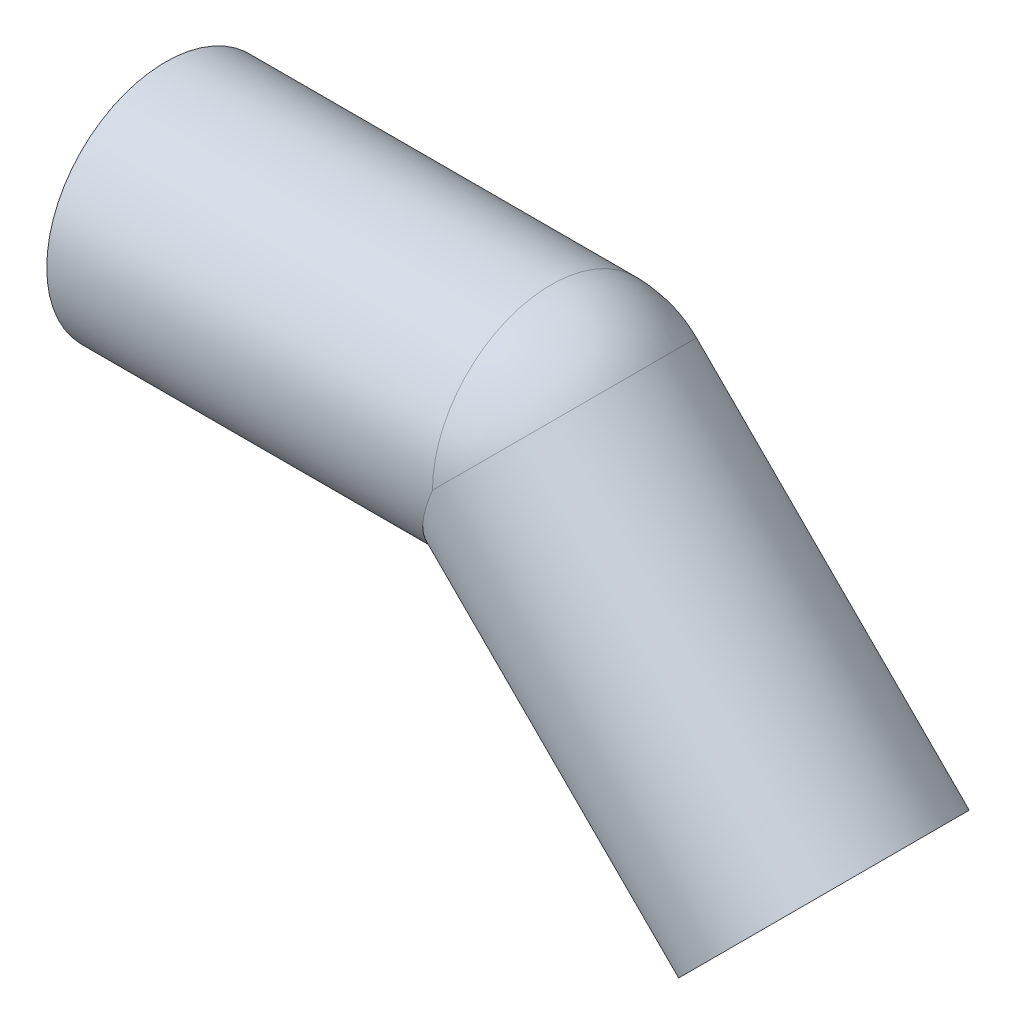
ISO-10303-21;
HEADER;
FILE_DESCRIPTION(('STEP AP214'),'2;1');
FILE_NAME('part.step','',(''),(''),'','','');
FILE_SCHEMA(('AUTOMOTIVE_DESIGN { 1 0 10303 214 1 1 1 1 }'));
ENDSEC;
DATA;
#1=APPLICATION_CONTEXT('core data for automotive mechanical design processes');
#2=APPLICATION_PROTOCOL_DEFINITION('international standard','automotive_design',2000,#1);
#3=PRODUCT_CONTEXT('',#1,'mechanical');
#4=PRODUCT('Part','Part','',(#3));
#5=PRODUCT_RELATED_PRODUCT_CATEGORY('part','',(#4));
#6=PRODUCT_DEFINITION_FORMATION('','',#4);
#7=PRODUCT_DEFINITION_CONTEXT('part definition',#1,'design');
#8=PRODUCT_DEFINITION('design','',#6,#7);
#9=PRODUCT_DEFINITION_SHAPE('','',#8);
#10=(LENGTH_UNIT() NAMED_UNIT(*) SI_UNIT(.MILLI.,.METRE.));
#11=(NAMED_UNIT(*) PLANE_ANGLE_UNIT() SI_UNIT($,.RADIAN.));
#12=(NAMED_UNIT(*) SI_UNIT($,.STERADIAN.) SOLID_ANGLE_UNIT());
#13=UNCERTAINTY_MEASURE_WITH_UNIT(LENGTH_MEASURE(1.E-05),#10,'distance_accuracy_value','');
#14=(GEOMETRIC_REPRESENTATION_CONTEXT(3) GLOBAL_UNCERTAINTY_ASSIGNED_CONTEXT((#13)) GLOBAL_UNIT_ASSIGNED_CONTEXT((#10,
#11,#12)) REPRESENTATION_CONTEXT('',''));
#15=CARTESIAN_POINT('',(0.,0.,0.));
#16=DIRECTION('',(0.,0.,1.));
#17=DIRECTION('',(1.,0.,0.));
#18=AXIS2_PLACEMENT_3D('',#15,#16,#17);
#19=CARTESIAN_POINT('',(88.7695526217002,-36.7695526217012,0.));
#20=DIRECTION('',(-0.707106781186531,0.707106781186564,0.));
#21=DIRECTION('',(-0.707106781186564,-0.707106781186531,0.));
#22=AXIS2_PLACEMENT_3D('',#19,#20,#21);
#23=CYLINDRICAL_SURFACE('',#22,13.6);
#24=CARTESIAN_POINT('',(52.,0.,0.));
#25=DIRECTION('',(0.707106781186547,-0.707106781186548,0.));
#26=DIRECTION('',(0.,0.,-1.));
#27=AXIS2_PLACEMENT_3D('',#24,#25,#26);
#28=CIRCLE('',#27,13.6);
#29=CARTESIAN_POINT('',(61.6166522244259,9.61665222384815,0.));
#30=VERTEX_POINT('',#29);
#31=CARTESIAN_POINT('',(52.0000000000007,-2.89352133305626E-13,13.6));
#32=VERTEX_POINT('',#31);
#33=EDGE_CURVE('E53',#30,#32,#28,.T.);
#34=ORIENTED_EDGE('',*,*,#33,.F.);
#35=CARTESIAN_POINT('',(52.,0.,0.));
#36=DIRECTION('',(0.707106781122822,-0.707106781250273,0.));
#37=DIRECTION('',(0.,0.,-1.));
#38=AXIS2_PLACEMENT_3D('',#35,#36,#37);
#39=CIRCLE('',#38,13.6);
#40=CARTESIAN_POINT('',(52.0000000000007,-2.79811478516556E-13,-13.6));
#41=VERTEX_POINT('',#40);
#42=EDGE_CURVE('E46',#41,#30,#39,.T.);
#43=ORIENTED_EDGE('',*,*,#42,.F.);
#44=CARTESIAN_POINT('',(52.0000000000008,0.,0.));
#45=DIRECTION('',(-0.923879532511282,0.382683432365101,0.));
#46=DIRECTION('',(-0.382683432365101,-0.923879532511282,0.));
#47=AXIS2_PLACEMENT_3D('',#44,#45,#46);
#48=ELLIPSE('',#47,14.7205339239766,13.6);
#49=EDGE_CURVE('E55',#32,#41,#48,.F.);
#50=ORIENTED_EDGE('',*,*,#49,.F.);
#51=EDGE_LOOP('',(#34,#43,#50));
#52=FACE_BOUND('',#51,.T.);
#53=CARTESIAN_POINT('',(88.7695526216998,-36.7695526217007,0.));
#54=DIRECTION('',(-0.70710678118653,0.707106781186565,0.));
#55=DIRECTION('',(-0.707106781186565,-0.70710678118653,0.));
#56=AXIS2_PLACEMENT_3D('',#53,#54,#55);
#57=CIRCLE('',#56,13.6);
#58=CARTESIAN_POINT('',(79.1529003975624,-46.3862048458376,0.));
#59=VERTEX_POINT('',#58);
#60=EDGE_CURVE('E18',#59,#59,#57,.T.);
#61=ORIENTED_EDGE('',*,*,#60,.F.);
#62=EDGE_LOOP('',(#61));
#63=FACE_BOUND('',#62,.T.);
#64=ADVANCED_FACE('F15',(#52,#63),#23,.F.);
#65=CARTESIAN_POINT('',(52.,0.,0.));
#66=DIRECTION('',(0.,0.,1.));
#67=DIRECTION('',(-1.,0.,0.));
#68=AXIS2_PLACEMENT_3D('',#65,#66,#67);
#69=SPHERICAL_SURFACE('',#68,13.6);
#70=CARTESIAN_POINT('',(52.,0.,0.));
#71=DIRECTION('',(-1.,0.,0.));
#72=DIRECTION('',(0.,1.,0.));
#73=AXIS2_PLACEMENT_3D('',#70,#71,#72);
#74=CIRCLE('',#73,13.6);
#75=EDGE_CURVE('E51',#41,#32,#74,.F.);
#76=ORIENTED_EDGE('',*,*,#75,.F.);
#77=ORIENTED_EDGE('',*,*,#42,.T.);
#78=ORIENTED_EDGE('',*,*,#33,.T.);
#79=EDGE_LOOP('',(#76,#77,#78));
#80=FACE_BOUND('',#79,.T.);
#81=ADVANCED_FACE('F58',(#80),#69,.F.);
#82=CARTESIAN_POINT('',(100.083261120685,-25.4558441227157,16.1920021082981));
#83=DIRECTION('',(0.707106781186547,-0.707106781186548,0.));
#84=DIRECTION('',(-0.707106781186548,-0.707106781186547,0.));
#85=AXIS2_PLACEMENT_3D('',#82,#83,#84);
#86=PLANE('',#85);
#87=ORIENTED_EDGE('',*,*,#60,.T.);
#88=EDGE_LOOP('',(#87));
#89=FACE_BOUND('',#88,.T.);
#90=CARTESIAN_POINT('',(88.7695526216997,-36.7695526217007,0.));
#91=DIRECTION('',(-0.70710678118653,0.707106781186565,0.));
#92=DIRECTION('',(-0.707106781186565,-0.70710678118653,0.));
#93=AXIS2_PLACEMENT_3D('',#90,#91,#92);
#94=CIRCLE('',#93,16.);
#95=CARTESIAN_POINT('',(77.4558441227147,-48.0832611206852,0.));
#96=VERTEX_POINT('',#95);
#97=EDGE_CURVE('E75',#96,#96,#94,.T.);
#98=ORIENTED_EDGE('',*,*,#97,.F.);
#99=EDGE_LOOP('',(#98));
#100=FACE_BOUND('',#99,.T.);
#101=ADVANCED_FACE('F85',(#89,#100),#86,.T.);
#102=CARTESIAN_POINT('',(52.,0.,0.));
#103=DIRECTION('',(-1.,0.,0.));
#104=DIRECTION('',(0.,0.,1.));
#105=AXIS2_PLACEMENT_3D('',#102,#103,#104);
#106=CYLINDRICAL_SURFACE('',#105,13.6);
#107=CARTESIAN_POINT('',(0.,0.,0.));
#108=DIRECTION('',(-1.,0.,0.));
#109=DIRECTION('',(0.,0.,1.));
#110=AXIS2_PLACEMENT_3D('',#107,#108,#109);
#111=CIRCLE('',#110,13.6);
#112=CARTESIAN_POINT('',(0.,0.,13.6));
#113=VERTEX_POINT('',#112);
#114=EDGE_CURVE('E72',#113,#113,#111,.F.);
#115=ORIENTED_EDGE('',*,*,#114,.F.);
#116=EDGE_LOOP('',(#115));
#117=FACE_BOUND('',#116,.T.);
#118=ORIENTED_EDGE('',*,*,#49,.T.);
#119=ORIENTED_EDGE('',*,*,#75,.T.);
#120=EDGE_LOOP('',(#118,#119));
#121=FACE_BOUND('',#120,.T.);
#122=ADVANCED_FACE('F88',(#117,#121),#106,.F.);
#123=CARTESIAN_POINT('',(52.,0.,0.));
#124=DIRECTION('',(0.,0.,1.));
#125=DIRECTION('',(1.,0.,0.));
#126=AXIS2_PLACEMENT_3D('',#123,#124,#125);
#127=SPHERICAL_SURFACE('',#126,16.);
#128=CARTESIAN_POINT('',(52.,0.,0.));
#129=DIRECTION('',(-1.,0.,0.));
#130=DIRECTION('',(0.,1.,0.));
#131=AXIS2_PLACEMENT_3D('',#128,#129,#130);
#132=CIRCLE('',#131,16.);
#133=CARTESIAN_POINT('',(52.0000000000007,-3.26194231330408E-13,16.));
#134=VERTEX_POINT('',#133);
#135=CARTESIAN_POINT('',(52.0000000000007,-3.33926333016187E-13,-15.9999999999999));
#136=VERTEX_POINT('',#135);
#137=EDGE_CURVE('E71',#134,#136,#132,.T.);
#138=ORIENTED_EDGE('',*,*,#137,.F.);
#139=CARTESIAN_POINT('',(52.,0.,0.));
#140=DIRECTION('',(-0.707106781229083,0.707106781144012,0.));
#141=DIRECTION('',(0.,0.,1.));
#142=AXIS2_PLACEMENT_3D('',#139,#140,#141);
#143=CIRCLE('',#142,16.);
#144=CARTESIAN_POINT('',(63.3137084986446,11.3137084993249,0.));
#145=VERTEX_POINT('',#144);
#146=EDGE_CURVE('E77',#134,#145,#143,.T.);
#147=ORIENTED_EDGE('',*,*,#146,.T.);
#148=CARTESIAN_POINT('',(52.0000000000004,4.16333634234434E-13,0.));
#149=DIRECTION('',(-0.70710678118653,0.707106781186565,0.));
#150=DIRECTION('',(0.707106781186565,0.70710678118653,0.));
#151=AXIS2_PLACEMENT_3D('',#148,#149,#150);
#152=CIRCLE('',#151,15.9999999999994);
#153=EDGE_CURVE('E33',#136,#145,#152,.F.);
#154=ORIENTED_EDGE('',*,*,#153,.F.);
#155=EDGE_LOOP('',(#138,#147,#154));
#156=FACE_BOUND('',#155,.T.);
#157=ADVANCED_FACE('F92',(#156),#127,.T.);
#158=CARTESIAN_POINT('',(52.0000000000004,4.28476698566271E-13,0.));
#159=DIRECTION('',(-0.70710678118653,0.707106781186565,0.));
#160=DIRECTION('',(-0.707106781186565,-0.70710678118653,0.));
#161=AXIS2_PLACEMENT_3D('',#158,#159,#160);
#162=CYLINDRICAL_SURFACE('',#161,16.);
#163=ORIENTED_EDGE('',*,*,#97,.T.);
#164=EDGE_LOOP('',(#163));
#165=FACE_BOUND('',#164,.T.);
#166=CARTESIAN_POINT('',(52.0000000000009,0.,0.));
#167=DIRECTION('',(-0.923879532511282,0.382683432365101,0.));
#168=DIRECTION('',(-0.382683432365101,-0.923879532511282,0.));
#169=AXIS2_PLACEMENT_3D('',#166,#167,#168);
#170=ELLIPSE('',#169,17.3182752046784,16.);
#171=EDGE_CURVE('E24',#136,#134,#170,.T.);
#172=ORIENTED_EDGE('',*,*,#171,.F.);
#173=ORIENTED_EDGE('',*,*,#153,.T.);
#174=ORIENTED_EDGE('',*,*,#146,.F.);
#175=EDGE_LOOP('',(#172,#173,#174));
#176=FACE_BOUND('',#175,.T.);
#177=ADVANCED_FACE('F97',(#165,#176),#162,.T.);
#178=CARTESIAN_POINT('',(0.,-16.,16.1920021084034));
#179=DIRECTION('',(-1.,0.,0.));
#180=DIRECTION('',(0.,1.,0.));
#181=AXIS2_PLACEMENT_3D('',#178,#179,#180);
#182=PLANE('',#181);
#183=ORIENTED_EDGE('',*,*,#114,.T.);
#184=EDGE_LOOP('',(#183));
#185=FACE_BOUND('',#184,.T.);
#186=CARTESIAN_POINT('',(0.,0.,0.));
#187=DIRECTION('',(-1.,0.,0.));
#188=DIRECTION('',(0.,0.,1.));
#189=AXIS2_PLACEMENT_3D('',#186,#187,#188);
#190=CIRCLE('',#189,16.);
#191=CARTESIAN_POINT('',(0.,0.,16.));
#192=VERTEX_POINT('',#191);
#193=EDGE_CURVE('E9',#192,#192,#190,.F.);
#194=ORIENTED_EDGE('',*,*,#193,.F.);
#195=EDGE_LOOP('',(#194));
#196=FACE_BOUND('',#195,.T.);
#197=ADVANCED_FACE('F113',(#185,#196),#182,.T.);
#198=CARTESIAN_POINT('',(0.,0.,0.));
#199=DIRECTION('',(-1.,0.,0.));
#200=DIRECTION('',(0.,0.,1.));
#201=AXIS2_PLACEMENT_3D('',#198,#199,#200);
#202=CYLINDRICAL_SURFACE('',#201,16.);
#203=ORIENTED_EDGE('',*,*,#171,.T.);
#204=ORIENTED_EDGE('',*,*,#137,.T.);
#205=EDGE_LOOP('',(#203,#204));
#206=FACE_BOUND('',#205,.T.);
#207=ORIENTED_EDGE('',*,*,#193,.T.);
#208=EDGE_LOOP('',(#207));
#209=FACE_BOUND('',#208,.T.);
#210=ADVANCED_FACE('F110',(#206,#209),#202,.T.);
#211=CLOSED_SHELL('',(#64,#81,#101,#122,#157,#177,#197,#210));
#212=MANIFOLD_SOLID_BREP('B1',#211);
#213=ADVANCED_BREP_SHAPE_REPRESENTATION('',(#18,#212),#14);
#214=SHAPE_DEFINITION_REPRESENTATION(#9,#213);
ENDSEC;
END-ISO-10303-21;
